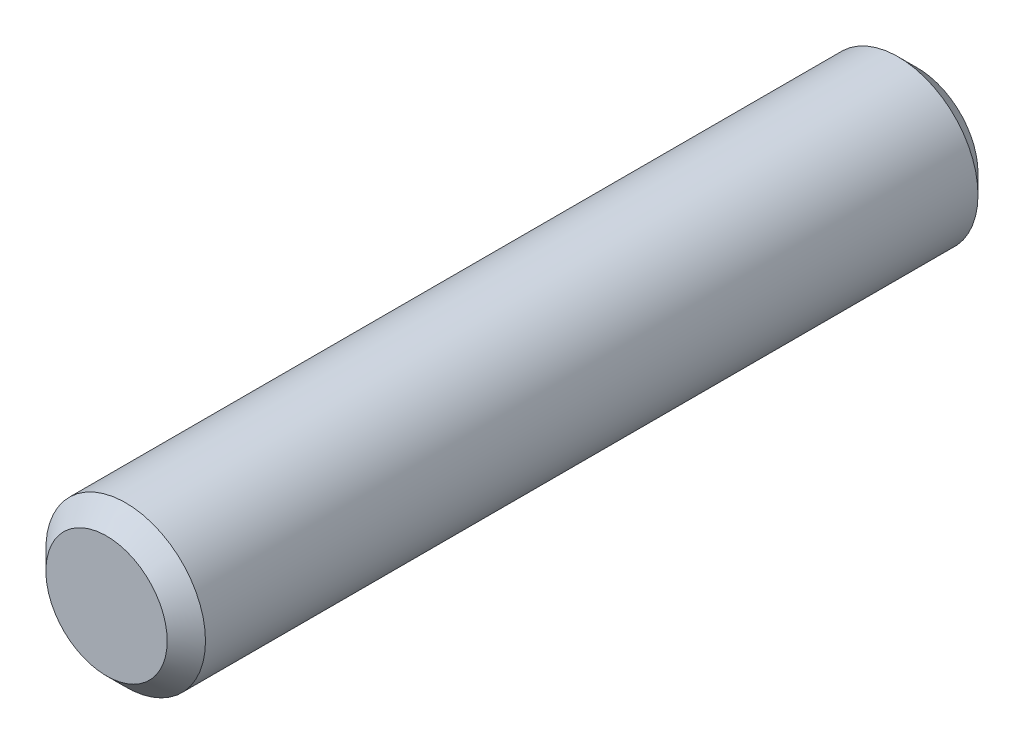
ISO-10303-21;
HEADER;
FILE_DESCRIPTION(('STEP AP214'),'2;1');
FILE_NAME('part.step','',(''),(''),'','','');
FILE_SCHEMA(('AUTOMOTIVE_DESIGN { 1 0 10303 214 1 1 1 1 }'));
ENDSEC;
DATA;
#1=APPLICATION_CONTEXT('core data for automotive mechanical design processes');
#2=APPLICATION_PROTOCOL_DEFINITION('international standard','automotive_design',2000,#1);
#3=PRODUCT_CONTEXT('',#1,'mechanical');
#4=PRODUCT('Part','Part','',(#3));
#5=PRODUCT_RELATED_PRODUCT_CATEGORY('part','',(#4));
#6=PRODUCT_DEFINITION_FORMATION('','',#4);
#7=PRODUCT_DEFINITION_CONTEXT('part definition',#1,'design');
#8=PRODUCT_DEFINITION('design','',#6,#7);
#9=PRODUCT_DEFINITION_SHAPE('','',#8);
#10=(LENGTH_UNIT() NAMED_UNIT(*) SI_UNIT(.MILLI.,.METRE.));
#11=(NAMED_UNIT(*) PLANE_ANGLE_UNIT() SI_UNIT($,.RADIAN.));
#12=(NAMED_UNIT(*) SI_UNIT($,.STERADIAN.) SOLID_ANGLE_UNIT());
#13=UNCERTAINTY_MEASURE_WITH_UNIT(LENGTH_MEASURE(1.E-05),#10,'distance_accuracy_value','');
#14=(GEOMETRIC_REPRESENTATION_CONTEXT(3) GLOBAL_UNCERTAINTY_ASSIGNED_CONTEXT((#13)) GLOBAL_UNIT_ASSIGNED_CONTEXT((#10,
#11,#12)) REPRESENTATION_CONTEXT('',''));
#15=CARTESIAN_POINT('',(0.,0.,0.));
#16=DIRECTION('',(0.,0.,1.));
#17=DIRECTION('',(1.,0.,0.));
#18=AXIS2_PLACEMENT_3D('',#15,#16,#17);
#19=CARTESIAN_POINT('',(0.,0.,127.));
#20=DIRECTION('',(0.,0.,-1.));
#21=DIRECTION('',(-1.,0.,0.));
#22=AXIS2_PLACEMENT_3D('',#19,#20,#21);
#23=CYLINDRICAL_SURFACE('',#22,12.5);
#24=CARTESIAN_POINT('',(0.,0.,3.00000000000002));
#25=DIRECTION('',(0.,0.,1.));
#26=DIRECTION('',(1.,0.,0.));
#27=AXIS2_PLACEMENT_3D('',#24,#25,#26);
#28=CIRCLE('',#27,12.5);
#29=CARTESIAN_POINT('',(12.5,0.,3.00000000000002));
#30=VERTEX_POINT('',#29);
#31=EDGE_CURVE('E51',#30,#30,#28,.T.);
#32=ORIENTED_EDGE('',*,*,#31,.T.);
#33=EDGE_LOOP('',(#32));
#34=FACE_BOUND('',#33,.T.);
#35=CARTESIAN_POINT('',(0.,0.,124.));
#36=DIRECTION('',(0.,0.,1.));
#37=DIRECTION('',(1.,0.,0.));
#38=AXIS2_PLACEMENT_3D('',#35,#36,#37);
#39=CIRCLE('',#38,12.5);
#40=CARTESIAN_POINT('',(12.5,0.,124.));
#41=VERTEX_POINT('',#40);
#42=EDGE_CURVE('E55',#41,#41,#39,.F.);
#43=ORIENTED_EDGE('',*,*,#42,.T.);
#44=EDGE_LOOP('',(#43));
#45=FACE_BOUND('',#44,.T.);
#46=ADVANCED_FACE('F39',(#34,#45),#23,.T.);
#47=CARTESIAN_POINT('',(0.,0.,127.));
#48=DIRECTION('',(0.,0.,1.));
#49=DIRECTION('',(1.,0.,0.));
#50=AXIS2_PLACEMENT_3D('',#47,#48,#49);
#51=PLANE('',#50);
#52=CARTESIAN_POINT('',(0.,0.,127.));
#53=DIRECTION('',(0.,0.,1.));
#54=DIRECTION('',(1.,0.,0.));
#55=AXIS2_PLACEMENT_3D('',#52,#53,#54);
#56=CIRCLE('',#55,9.50000000000001);
#57=CARTESIAN_POINT('',(9.50000000000001,0.,127.));
#58=VERTEX_POINT('',#57);
#59=EDGE_CURVE('E10',#58,#58,#56,.T.);
#60=ORIENTED_EDGE('',*,*,#59,.T.);
#61=EDGE_LOOP('',(#60));
#62=FACE_BOUND('',#61,.T.);
#63=ADVANCED_FACE('F71',(#62),#51,.T.);
#64=CARTESIAN_POINT('',(0.,0.,0.));
#65=DIRECTION('',(0.,0.,1.));
#66=DIRECTION('',(1.,0.,0.));
#67=AXIS2_PLACEMENT_3D('',#64,#65,#66);
#68=PLANE('',#67);
#69=CARTESIAN_POINT('',(0.,0.,0.));
#70=DIRECTION('',(0.,0.,1.));
#71=DIRECTION('',(1.,0.,0.));
#72=AXIS2_PLACEMENT_3D('',#69,#70,#71);
#73=CIRCLE('',#72,9.49999999999999);
#74=CARTESIAN_POINT('',(9.49999999999999,0.,0.));
#75=VERTEX_POINT('',#74);
#76=EDGE_CURVE('E47',#75,#75,#73,.F.);
#77=ORIENTED_EDGE('',*,*,#76,.T.);
#78=EDGE_LOOP('',(#77));
#79=FACE_BOUND('',#78,.T.);
#80=ADVANCED_FACE('F68',(#79),#68,.F.);
#81=CARTESIAN_POINT('',(0.,0.,3.00000000000002));
#82=DIRECTION('',(0.,0.,1.));
#83=DIRECTION('',(1.,0.,0.));
#84=AXIS2_PLACEMENT_3D('',#81,#82,#83);
#85=CONICAL_SURFACE('',#84,12.5,0.785398163397447);
#86=ORIENTED_EDGE('',*,*,#76,.F.);
#87=EDGE_LOOP('',(#86));
#88=FACE_BOUND('',#87,.T.);
#89=ORIENTED_EDGE('',*,*,#31,.F.);
#90=EDGE_LOOP('',(#89));
#91=FACE_BOUND('',#90,.T.);
#92=ADVANCED_FACE('F64',(#88,#91),#85,.T.);
#93=CARTESIAN_POINT('',(0.,0.,127.));
#94=DIRECTION('',(0.,0.,-1.));
#95=DIRECTION('',(-1.,0.,0.));
#96=AXIS2_PLACEMENT_3D('',#93,#94,#95);
#97=CONICAL_SURFACE('',#96,9.50000000000001,0.785398163397447);
#98=ORIENTED_EDGE('',*,*,#42,.F.);
#99=EDGE_LOOP('',(#98));
#100=FACE_BOUND('',#99,.T.);
#101=ORIENTED_EDGE('',*,*,#59,.F.);
#102=EDGE_LOOP('',(#101));
#103=FACE_BOUND('',#102,.T.);
#104=ADVANCED_FACE('F42',(#100,#103),#97,.T.);
#105=CLOSED_SHELL('',(#46,#63,#80,#92,#104));
#106=MANIFOLD_SOLID_BREP('B2',#105);
#107=ADVANCED_BREP_SHAPE_REPRESENTATION('',(#18,#106),#14);
#108=SHAPE_DEFINITION_REPRESENTATION(#9,#107);
ENDSEC;
END-ISO-10303-21;
